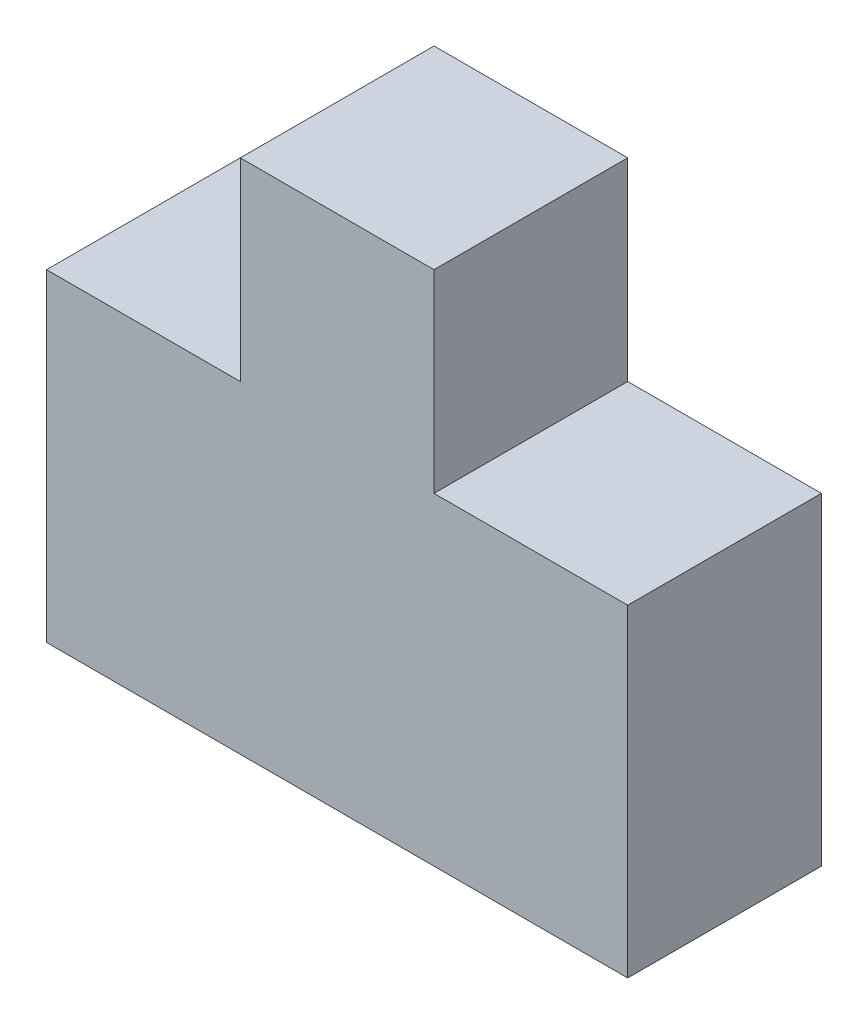
ISO-10303-21;
HEADER;
FILE_DESCRIPTION(('STEP AP214'),'2;1');
FILE_NAME('part.step','',(''),(''),'','','');
FILE_SCHEMA(('AUTOMOTIVE_DESIGN { 1 0 10303 214 1 1 1 1 }'));
ENDSEC;
DATA;
#1=APPLICATION_CONTEXT('core data for automotive mechanical design processes');
#2=APPLICATION_PROTOCOL_DEFINITION('international standard','automotive_design',2000,#1);
#3=PRODUCT_CONTEXT('',#1,'mechanical');
#4=PRODUCT('Part','Part','',(#3));
#5=PRODUCT_RELATED_PRODUCT_CATEGORY('part','',(#4));
#6=PRODUCT_DEFINITION_FORMATION('','',#4);
#7=PRODUCT_DEFINITION_CONTEXT('part definition',#1,'design');
#8=PRODUCT_DEFINITION('design','',#6,#7);
#9=PRODUCT_DEFINITION_SHAPE('','',#8);
#10=(LENGTH_UNIT() NAMED_UNIT(*) SI_UNIT(.MILLI.,.METRE.));
#11=(NAMED_UNIT(*) PLANE_ANGLE_UNIT() SI_UNIT($,.RADIAN.));
#12=(NAMED_UNIT(*) SI_UNIT($,.STERADIAN.) SOLID_ANGLE_UNIT());
#13=UNCERTAINTY_MEASURE_WITH_UNIT(LENGTH_MEASURE(1.E-05),#10,'distance_accuracy_value','');
#14=(GEOMETRIC_REPRESENTATION_CONTEXT(3) GLOBAL_UNCERTAINTY_ASSIGNED_CONTEXT((#13)) GLOBAL_UNIT_ASSIGNED_CONTEXT((#10,
#11,#12)) REPRESENTATION_CONTEXT('',''));
#15=CARTESIAN_POINT('',(0.,0.,0.));
#16=DIRECTION('',(0.,0.,1.));
#17=DIRECTION('',(1.,0.,0.));
#18=AXIS2_PLACEMENT_3D('',#15,#16,#17);
#19=CARTESIAN_POINT('',(45.,0.,30.));
#20=DIRECTION('',(-1.,0.,0.));
#21=DIRECTION('',(0.,-1.,0.));
#22=AXIS2_PLACEMENT_3D('',#19,#20,#21);
#23=PLANE('',#22);
#24=DIRECTION('',(0.,1.,0.));
#25=VECTOR('',#24,1.);
#26=CARTESIAN_POINT('',(45.,0.,0.));
#27=LINE('',#26,#25);
#28=CARTESIAN_POINT('',(45.,0.,0.));
#29=VERTEX_POINT('',#28);
#30=CARTESIAN_POINT('',(45.,50.,0.));
#31=VERTEX_POINT('',#30);
#32=EDGE_CURVE('E129',#29,#31,#27,.T.);
#33=ORIENTED_EDGE('',*,*,#32,.T.);
#34=DIRECTION('',(0.,0.,-1.));
#35=VECTOR('',#34,1.);
#36=CARTESIAN_POINT('',(45.,50.,30.));
#37=LINE('',#36,#35);
#38=CARTESIAN_POINT('',(45.,50.,30.));
#39=VERTEX_POINT('',#38);
#40=EDGE_CURVE('E11',#39,#31,#37,.T.);
#41=ORIENTED_EDGE('',*,*,#40,.F.);
#42=DIRECTION('',(0.,1.,0.));
#43=VECTOR('',#42,1.);
#44=CARTESIAN_POINT('',(45.,0.,30.));
#45=LINE('',#44,#43);
#46=CARTESIAN_POINT('',(45.,0.,30.));
#47=VERTEX_POINT('',#46);
#48=EDGE_CURVE('E143',#47,#39,#45,.T.);
#49=ORIENTED_EDGE('',*,*,#48,.F.);
#50=DIRECTION('',(0.,0.,-1.));
#51=VECTOR('',#50,1.);
#52=CARTESIAN_POINT('',(45.,0.,30.));
#53=LINE('',#52,#51);
#54=EDGE_CURVE('E125',#47,#29,#53,.T.);
#55=ORIENTED_EDGE('',*,*,#54,.T.);
#56=EDGE_LOOP('',(#33,#41,#49,#55));
#57=FACE_BOUND('',#56,.T.);
#58=ADVANCED_FACE('F33',(#57),#23,.F.);
#59=CARTESIAN_POINT('',(45.,50.,30.));
#60=DIRECTION('',(0.,-1.,0.));
#61=DIRECTION('',(1.,0.,0.));
#62=AXIS2_PLACEMENT_3D('',#59,#60,#61);
#63=PLANE('',#62);
#64=DIRECTION('',(-1.,0.,0.));
#65=VECTOR('',#64,1.);
#66=CARTESIAN_POINT('',(45.,50.,0.));
#67=LINE('',#66,#65);
#68=CARTESIAN_POINT('',(15.,50.,0.));
#69=VERTEX_POINT('',#68);
#70=EDGE_CURVE('E132',#31,#69,#67,.T.);
#71=ORIENTED_EDGE('',*,*,#70,.T.);
#72=DIRECTION('',(0.,0.,-1.));
#73=VECTOR('',#72,1.);
#74=CARTESIAN_POINT('',(15.,50.,30.));
#75=LINE('',#74,#73);
#76=CARTESIAN_POINT('',(15.,50.,30.));
#77=VERTEX_POINT('',#76);
#78=EDGE_CURVE('E41',#77,#69,#75,.T.);
#79=ORIENTED_EDGE('',*,*,#78,.F.);
#80=DIRECTION('',(-1.,0.,0.));
#81=VECTOR('',#80,1.);
#82=CARTESIAN_POINT('',(45.,50.,30.));
#83=LINE('',#82,#81);
#84=EDGE_CURVE('E92',#39,#77,#83,.T.);
#85=ORIENTED_EDGE('',*,*,#84,.F.);
#86=ORIENTED_EDGE('',*,*,#40,.T.);
#87=EDGE_LOOP('',(#71,#79,#85,#86));
#88=FACE_BOUND('',#87,.T.);
#89=ADVANCED_FACE('F178',(#88),#63,.F.);
#90=CARTESIAN_POINT('',(15.,80.,30.));
#91=DIRECTION('',(-1.,0.,0.));
#92=DIRECTION('',(0.,-1.,0.));
#93=AXIS2_PLACEMENT_3D('',#90,#91,#92);
#94=PLANE('',#93);
#95=DIRECTION('',(0.,1.,0.));
#96=VECTOR('',#95,1.);
#97=CARTESIAN_POINT('',(15.,80.,0.));
#98=LINE('',#97,#96);
#99=CARTESIAN_POINT('',(15.,80.,0.));
#100=VERTEX_POINT('',#99);
#101=EDGE_CURVE('E134',#69,#100,#98,.T.);
#102=ORIENTED_EDGE('',*,*,#101,.T.);
#103=DIRECTION('',(0.,0.,-1.));
#104=VECTOR('',#103,1.);
#105=CARTESIAN_POINT('',(15.,80.,30.));
#106=LINE('',#105,#104);
#107=CARTESIAN_POINT('',(15.,80.,30.));
#108=VERTEX_POINT('',#107);
#109=EDGE_CURVE('E150',#108,#100,#106,.T.);
#110=ORIENTED_EDGE('',*,*,#109,.F.);
#111=DIRECTION('',(0.,1.,0.));
#112=VECTOR('',#111,1.);
#113=CARTESIAN_POINT('',(15.,80.,30.));
#114=LINE('',#113,#112);
#115=EDGE_CURVE('E158',#77,#108,#114,.T.);
#116=ORIENTED_EDGE('',*,*,#115,.F.);
#117=ORIENTED_EDGE('',*,*,#78,.T.);
#118=EDGE_LOOP('',(#102,#110,#116,#117));
#119=FACE_BOUND('',#118,.T.);
#120=ADVANCED_FACE('F156',(#119),#94,.F.);
#121=CARTESIAN_POINT('',(-15.,80.,30.));
#122=DIRECTION('',(0.,-1.,0.));
#123=DIRECTION('',(0.,0.,-1.));
#124=AXIS2_PLACEMENT_3D('',#121,#122,#123);
#125=PLANE('',#124);
#126=DIRECTION('',(-1.,0.,0.));
#127=VECTOR('',#126,1.);
#128=CARTESIAN_POINT('',(-15.,80.,0.));
#129=LINE('',#128,#127);
#130=CARTESIAN_POINT('',(-15.,80.,0.));
#131=VERTEX_POINT('',#130);
#132=EDGE_CURVE('E136',#100,#131,#129,.T.);
#133=ORIENTED_EDGE('',*,*,#132,.T.);
#134=DIRECTION('',(0.,0.,-1.));
#135=VECTOR('',#134,1.);
#136=CARTESIAN_POINT('',(-15.,80.,30.));
#137=LINE('',#136,#135);
#138=CARTESIAN_POINT('',(-15.,80.,30.));
#139=VERTEX_POINT('',#138);
#140=EDGE_CURVE('E147',#139,#131,#137,.T.);
#141=ORIENTED_EDGE('',*,*,#140,.F.);
#142=DIRECTION('',(-1.,0.,0.));
#143=VECTOR('',#142,1.);
#144=CARTESIAN_POINT('',(-15.,80.,30.));
#145=LINE('',#144,#143);
#146=EDGE_CURVE('E170',#108,#139,#145,.T.);
#147=ORIENTED_EDGE('',*,*,#146,.F.);
#148=ORIENTED_EDGE('',*,*,#109,.T.);
#149=EDGE_LOOP('',(#133,#141,#147,#148));
#150=FACE_BOUND('',#149,.T.);
#151=ADVANCED_FACE('F166',(#150),#125,.F.);
#152=CARTESIAN_POINT('',(-15.,50.,30.));
#153=DIRECTION('',(1.,0.,0.));
#154=DIRECTION('',(0.,1.,0.));
#155=AXIS2_PLACEMENT_3D('',#152,#153,#154);
#156=PLANE('',#155);
#157=DIRECTION('',(0.,-1.,0.));
#158=VECTOR('',#157,1.);
#159=CARTESIAN_POINT('',(-15.,50.,0.));
#160=LINE('',#159,#158);
#161=CARTESIAN_POINT('',(-15.,50.,0.));
#162=VERTEX_POINT('',#161);
#163=EDGE_CURVE('E138',#131,#162,#160,.T.);
#164=ORIENTED_EDGE('',*,*,#163,.T.);
#165=DIRECTION('',(0.,0.,-1.));
#166=VECTOR('',#165,1.);
#167=CARTESIAN_POINT('',(-15.,50.,30.));
#168=LINE('',#167,#166);
#169=CARTESIAN_POINT('',(-15.,50.,30.));
#170=VERTEX_POINT('',#169);
#171=EDGE_CURVE('E120',#170,#162,#168,.T.);
#172=ORIENTED_EDGE('',*,*,#171,.F.);
#173=DIRECTION('',(0.,-1.,0.));
#174=VECTOR('',#173,1.);
#175=CARTESIAN_POINT('',(-15.,50.,30.));
#176=LINE('',#175,#174);
#177=EDGE_CURVE('E111',#139,#170,#176,.T.);
#178=ORIENTED_EDGE('',*,*,#177,.F.);
#179=ORIENTED_EDGE('',*,*,#140,.T.);
#180=EDGE_LOOP('',(#164,#172,#178,#179));
#181=FACE_BOUND('',#180,.T.);
#182=ADVANCED_FACE('F169',(#181),#156,.F.);
#183=CARTESIAN_POINT('',(-45.,50.,30.));
#184=DIRECTION('',(0.,-1.,0.));
#185=DIRECTION('',(1.,0.,0.));
#186=AXIS2_PLACEMENT_3D('',#183,#184,#185);
#187=PLANE('',#186);
#188=DIRECTION('',(-1.,0.,0.));
#189=VECTOR('',#188,1.);
#190=CARTESIAN_POINT('',(-45.,50.,0.));
#191=LINE('',#190,#189);
#192=CARTESIAN_POINT('',(-45.,50.,0.));
#193=VERTEX_POINT('',#192);
#194=EDGE_CURVE('E119',#162,#193,#191,.T.);
#195=ORIENTED_EDGE('',*,*,#194,.T.);
#196=DIRECTION('',(0.,0.,-1.));
#197=VECTOR('',#196,1.);
#198=CARTESIAN_POINT('',(-45.,50.,30.));
#199=LINE('',#198,#197);
#200=CARTESIAN_POINT('',(-45.,50.,30.));
#201=VERTEX_POINT('',#200);
#202=EDGE_CURVE('E116',#201,#193,#199,.T.);
#203=ORIENTED_EDGE('',*,*,#202,.F.);
#204=DIRECTION('',(-1.,0.,0.));
#205=VECTOR('',#204,1.);
#206=CARTESIAN_POINT('',(-45.,50.,30.));
#207=LINE('',#206,#205);
#208=EDGE_CURVE('E105',#170,#201,#207,.T.);
#209=ORIENTED_EDGE('',*,*,#208,.F.);
#210=ORIENTED_EDGE('',*,*,#171,.T.);
#211=EDGE_LOOP('',(#195,#203,#209,#210));
#212=FACE_BOUND('',#211,.T.);
#213=ADVANCED_FACE('F117',(#212),#187,.F.);
#214=CARTESIAN_POINT('',(-45.,0.,30.));
#215=DIRECTION('',(1.,0.,0.));
#216=DIRECTION('',(0.,1.,0.));
#217=AXIS2_PLACEMENT_3D('',#214,#215,#216);
#218=PLANE('',#217);
#219=DIRECTION('',(0.,-1.,0.));
#220=VECTOR('',#219,1.);
#221=CARTESIAN_POINT('',(-45.,0.,0.));
#222=LINE('',#221,#220);
#223=CARTESIAN_POINT('',(-45.,0.,0.));
#224=VERTEX_POINT('',#223);
#225=EDGE_CURVE('E78',#193,#224,#222,.T.);
#226=ORIENTED_EDGE('',*,*,#225,.T.);
#227=DIRECTION('',(0.,0.,-1.));
#228=VECTOR('',#227,1.);
#229=CARTESIAN_POINT('',(-45.,0.,30.));
#230=LINE('',#229,#228);
#231=CARTESIAN_POINT('',(-45.,0.,30.));
#232=VERTEX_POINT('',#231);
#233=EDGE_CURVE('E121',#232,#224,#230,.T.);
#234=ORIENTED_EDGE('',*,*,#233,.F.);
#235=DIRECTION('',(0.,-1.,0.));
#236=VECTOR('',#235,1.);
#237=CARTESIAN_POINT('',(-45.,0.,30.));
#238=LINE('',#237,#236);
#239=EDGE_CURVE('E109',#201,#232,#238,.T.);
#240=ORIENTED_EDGE('',*,*,#239,.F.);
#241=ORIENTED_EDGE('',*,*,#202,.T.);
#242=EDGE_LOOP('',(#226,#234,#240,#241));
#243=FACE_BOUND('',#242,.T.);
#244=ADVANCED_FACE('F123',(#243),#218,.F.);
#245=CARTESIAN_POINT('',(-45.,0.,30.));
#246=DIRECTION('',(0.,1.,0.));
#247=DIRECTION('',(-1.,0.,0.));
#248=AXIS2_PLACEMENT_3D('',#245,#246,#247);
#249=PLANE('',#248);
#250=DIRECTION('',(1.,0.,0.));
#251=VECTOR('',#250,1.);
#252=CARTESIAN_POINT('',(-45.,0.,0.));
#253=LINE('',#252,#251);
#254=EDGE_CURVE('E84',#224,#29,#253,.T.);
#255=ORIENTED_EDGE('',*,*,#254,.T.);
#256=ORIENTED_EDGE('',*,*,#54,.F.);
#257=DIRECTION('',(1.,0.,0.));
#258=VECTOR('',#257,1.);
#259=CARTESIAN_POINT('',(-45.,0.,30.));
#260=LINE('',#259,#258);
#261=EDGE_CURVE('E49',#232,#47,#260,.T.);
#262=ORIENTED_EDGE('',*,*,#261,.F.);
#263=ORIENTED_EDGE('',*,*,#233,.T.);
#264=EDGE_LOOP('',(#255,#256,#262,#263));
#265=FACE_BOUND('',#264,.T.);
#266=ADVANCED_FACE('F194',(#265),#249,.F.);
#267=CARTESIAN_POINT('',(0.,0.,30.));
#268=DIRECTION('',(0.,0.,1.));
#269=DIRECTION('',(1.,0.,0.));
#270=AXIS2_PLACEMENT_3D('',#267,#268,#269);
#271=PLANE('',#270);
#272=ORIENTED_EDGE('',*,*,#48,.T.);
#273=ORIENTED_EDGE('',*,*,#84,.T.);
#274=ORIENTED_EDGE('',*,*,#115,.T.);
#275=ORIENTED_EDGE('',*,*,#146,.T.);
#276=ORIENTED_EDGE('',*,*,#177,.T.);
#277=ORIENTED_EDGE('',*,*,#208,.T.);
#278=ORIENTED_EDGE('',*,*,#239,.T.);
#279=ORIENTED_EDGE('',*,*,#261,.T.);
#280=EDGE_LOOP('',(#272,#273,#274,#275,#276,#277,#278,#279));
#281=FACE_BOUND('',#280,.T.);
#282=ADVANCED_FACE('F107',(#281),#271,.T.);
#283=CARTESIAN_POINT('',(0.,0.,0.));
#284=DIRECTION('',(0.,0.,1.));
#285=DIRECTION('',(1.,0.,0.));
#286=AXIS2_PLACEMENT_3D('',#283,#284,#285);
#287=PLANE('',#286);
#288=ORIENTED_EDGE('',*,*,#32,.F.);
#289=ORIENTED_EDGE('',*,*,#254,.F.);
#290=ORIENTED_EDGE('',*,*,#225,.F.);
#291=ORIENTED_EDGE('',*,*,#194,.F.);
#292=ORIENTED_EDGE('',*,*,#163,.F.);
#293=ORIENTED_EDGE('',*,*,#132,.F.);
#294=ORIENTED_EDGE('',*,*,#101,.F.);
#295=ORIENTED_EDGE('',*,*,#70,.F.);
#296=EDGE_LOOP('',(#288,#289,#290,#291,#292,#293,#294,#295));
#297=FACE_BOUND('',#296,.T.);
#298=ADVANCED_FACE('F162',(#297),#287,.F.);
#299=CLOSED_SHELL('',(#58,#89,#120,#151,#182,#213,#244,#266,#282,#298));
#300=MANIFOLD_SOLID_BREP('B2',#299);
#301=ADVANCED_BREP_SHAPE_REPRESENTATION('',(#18,#300),#14);
#302=SHAPE_DEFINITION_REPRESENTATION(#9,#301);
ENDSEC;
END-ISO-10303-21;
